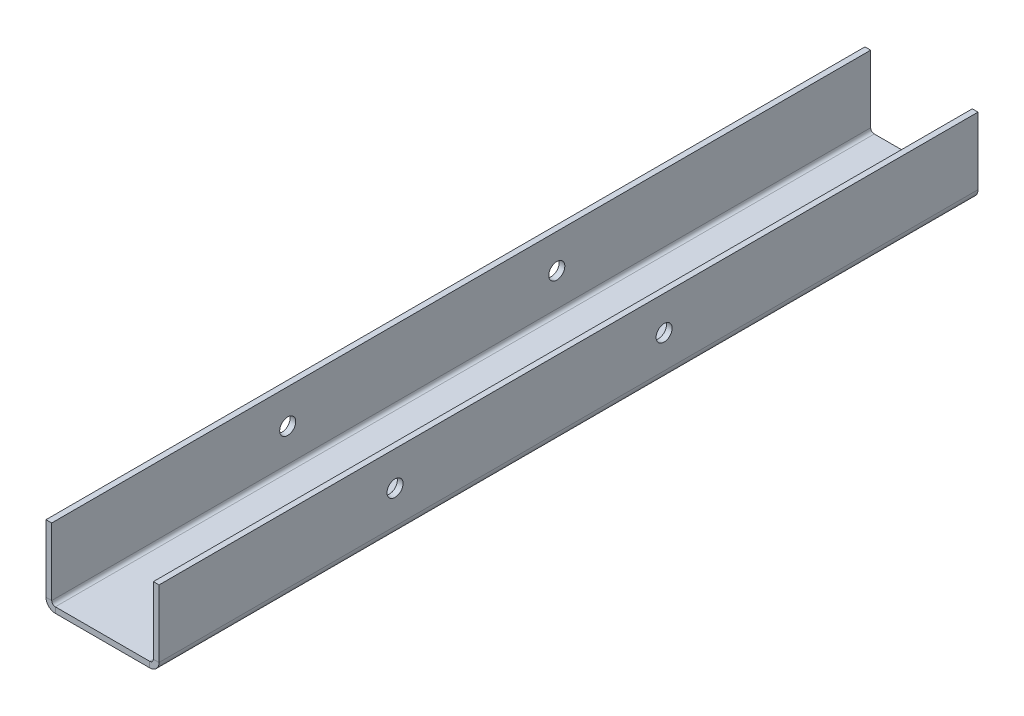
ISO-10303-21;
HEADER;
FILE_DESCRIPTION(('STEP AP214'),'2;1');
FILE_NAME('part.step','',(''),(''),'','','');
FILE_SCHEMA(('AUTOMOTIVE_DESIGN { 1 0 10303 214 1 1 1 1 }'));
ENDSEC;
DATA;
#1=APPLICATION_CONTEXT('core data for automotive mechanical design processes');
#2=APPLICATION_PROTOCOL_DEFINITION('international standard','automotive_design',2000,#1);
#3=PRODUCT_CONTEXT('',#1,'mechanical');
#4=PRODUCT('Part','Part','',(#3));
#5=PRODUCT_RELATED_PRODUCT_CATEGORY('part','',(#4));
#6=PRODUCT_DEFINITION_FORMATION('','',#4);
#7=PRODUCT_DEFINITION_CONTEXT('part definition',#1,'design');
#8=PRODUCT_DEFINITION('design','',#6,#7);
#9=PRODUCT_DEFINITION_SHAPE('','',#8);
#10=(LENGTH_UNIT() NAMED_UNIT(*) SI_UNIT(.MILLI.,.METRE.));
#11=(NAMED_UNIT(*) PLANE_ANGLE_UNIT() SI_UNIT($,.RADIAN.));
#12=(NAMED_UNIT(*) SI_UNIT($,.STERADIAN.) SOLID_ANGLE_UNIT());
#13=UNCERTAINTY_MEASURE_WITH_UNIT(LENGTH_MEASURE(1.E-05),#10,'distance_accuracy_value','');
#14=(GEOMETRIC_REPRESENTATION_CONTEXT(3) GLOBAL_UNCERTAINTY_ASSIGNED_CONTEXT((#13)) GLOBAL_UNIT_ASSIGNED_CONTEXT((#10,
#11,#12)) REPRESENTATION_CONTEXT('',''));
#15=CARTESIAN_POINT('',(0.,0.,0.));
#16=DIRECTION('',(0.,0.,1.));
#17=DIRECTION('',(1.,0.,0.));
#18=AXIS2_PLACEMENT_3D('',#15,#16,#17);
#19=CARTESIAN_POINT('',(10.,-1.21,-86.75));
#20=DIRECTION('',(0.,0.,-1.));
#21=DIRECTION('',(-1.,0.,0.));
#22=AXIS2_PLACEMENT_3D('',#19,#20,#21);
#23=PLANE('',#22);
#24=DIRECTION('',(-1.,0.,0.));
#25=VECTOR('',#24,1.);
#26=CARTESIAN_POINT('',(10.,0.,-86.75));
#27=LINE('',#26,#25);
#28=CARTESIAN_POINT('',(10.,0.,-86.75));
#29=VERTEX_POINT('',#28);
#30=CARTESIAN_POINT('',(-10.,0.,-86.75));
#31=VERTEX_POINT('',#30);
#32=EDGE_CURVE('E117',#29,#31,#27,.T.);
#33=ORIENTED_EDGE('',*,*,#32,.F.);
#34=DIRECTION('',(0.,1.,0.));
#35=VECTOR('',#34,1.);
#36=CARTESIAN_POINT('',(10.,-1.21,-86.75));
#37=LINE('',#36,#35);
#38=CARTESIAN_POINT('',(10.,-1.21,-86.75));
#39=VERTEX_POINT('',#38);
#40=EDGE_CURVE('E85',#39,#29,#37,.T.);
#41=ORIENTED_EDGE('',*,*,#40,.F.);
#42=DIRECTION('',(-1.,0.,0.));
#43=VECTOR('',#42,1.);
#44=CARTESIAN_POINT('',(10.,-1.21,-86.75));
#45=LINE('',#44,#43);
#46=CARTESIAN_POINT('',(-10.,-1.21,-86.75));
#47=VERTEX_POINT('',#46);
#48=EDGE_CURVE('E119',#39,#47,#45,.T.);
#49=ORIENTED_EDGE('',*,*,#48,.T.);
#50=DIRECTION('',(0.,1.,0.));
#51=VECTOR('',#50,1.);
#52=CARTESIAN_POINT('',(-10.,-1.21,-86.75));
#53=LINE('',#52,#51);
#54=EDGE_CURVE('E13',#47,#31,#53,.T.);
#55=ORIENTED_EDGE('',*,*,#54,.T.);
#56=EDGE_LOOP('',(#33,#41,#49,#55));
#57=FACE_BOUND('',#56,.T.);
#58=ADVANCED_FACE('F75',(#57),#23,.T.);
#59=CARTESIAN_POINT('',(10.,-1.21,86.75));
#60=DIRECTION('',(0.,0.,1.));
#61=DIRECTION('',(1.,0.,0.));
#62=AXIS2_PLACEMENT_3D('',#59,#60,#61);
#63=PLANE('',#62);
#64=DIRECTION('',(1.,0.,0.));
#65=VECTOR('',#64,1.);
#66=CARTESIAN_POINT('',(10.,0.,86.75));
#67=LINE('',#66,#65);
#68=CARTESIAN_POINT('',(-10.,0.,86.75));
#69=VERTEX_POINT('',#68);
#70=CARTESIAN_POINT('',(10.,0.,86.75));
#71=VERTEX_POINT('',#70);
#72=EDGE_CURVE('E140',#69,#71,#67,.T.);
#73=ORIENTED_EDGE('',*,*,#72,.F.);
#74=DIRECTION('',(0.,1.,0.));
#75=VECTOR('',#74,1.);
#76=CARTESIAN_POINT('',(-10.,-1.21,86.75));
#77=LINE('',#76,#75);
#78=CARTESIAN_POINT('',(-10.,-1.21,86.75));
#79=VERTEX_POINT('',#78);
#80=EDGE_CURVE('E162',#79,#69,#77,.T.);
#81=ORIENTED_EDGE('',*,*,#80,.F.);
#82=DIRECTION('',(1.,0.,0.));
#83=VECTOR('',#82,1.);
#84=CARTESIAN_POINT('',(10.,-1.21,86.75));
#85=LINE('',#84,#83);
#86=CARTESIAN_POINT('',(10.,-1.21,86.75));
#87=VERTEX_POINT('',#86);
#88=EDGE_CURVE('E156',#79,#87,#85,.T.);
#89=ORIENTED_EDGE('',*,*,#88,.T.);
#90=DIRECTION('',(0.,1.,0.));
#91=VECTOR('',#90,1.);
#92=CARTESIAN_POINT('',(10.,-1.21,86.75));
#93=LINE('',#92,#91);
#94=EDGE_CURVE('E167',#87,#71,#93,.T.);
#95=ORIENTED_EDGE('',*,*,#94,.T.);
#96=EDGE_LOOP('',(#73,#81,#89,#95));
#97=FACE_BOUND('',#96,.T.);
#98=ADVANCED_FACE('F77',(#97),#63,.T.);
#99=CARTESIAN_POINT('',(0.,-1.21,0.));
#100=DIRECTION('',(0.,1.,0.));
#101=DIRECTION('',(0.,0.,1.));
#102=AXIS2_PLACEMENT_3D('',#99,#100,#101);
#103=PLANE('',#102);
#104=CARTESIAN_POINT('',(0.,-1.21,69.75));
#105=DIRECTION('',(0.,-1.,0.));
#106=DIRECTION('',(0.,0.,-1.));
#107=AXIS2_PLACEMENT_3D('',#104,#105,#106);
#108=CIRCLE('',#107,1.20000000000001);
#109=CARTESIAN_POINT('',(0.,-1.21,68.55));
#110=VERTEX_POINT('',#109);
#111=EDGE_CURVE('E173',#110,#110,#108,.T.);
#112=ORIENTED_EDGE('',*,*,#111,.F.);
#113=EDGE_LOOP('',(#112));
#114=FACE_BOUND('',#113,.T.);
#115=DIRECTION('',(0.,0.,1.));
#116=VECTOR('',#115,1.);
#117=CARTESIAN_POINT('',(-10.,-1.21,86.75));
#118=LINE('',#117,#116);
#119=EDGE_CURVE('E94',#47,#79,#118,.T.);
#120=ORIENTED_EDGE('',*,*,#119,.F.);
#121=ORIENTED_EDGE('',*,*,#48,.F.);
#122=DIRECTION('',(0.,0.,-1.));
#123=VECTOR('',#122,1.);
#124=CARTESIAN_POINT('',(10.,-1.21,86.75));
#125=LINE('',#124,#123);
#126=EDGE_CURVE('E159',#87,#39,#125,.T.);
#127=ORIENTED_EDGE('',*,*,#126,.F.);
#128=ORIENTED_EDGE('',*,*,#88,.F.);
#129=EDGE_LOOP('',(#120,#121,#127,#128));
#130=FACE_BOUND('',#129,.T.);
#131=ADVANCED_FACE('F314',(#114,#130),#103,.F.);
#132=CARTESIAN_POINT('',(0.,0.,0.));
#133=DIRECTION('',(0.,1.,0.));
#134=DIRECTION('',(0.,0.,1.));
#135=AXIS2_PLACEMENT_3D('',#132,#133,#134);
#136=PLANE('',#135);
#137=CARTESIAN_POINT('',(0.,0.,69.75));
#138=DIRECTION('',(0.,1.,0.));
#139=DIRECTION('',(0.,0.,1.));
#140=AXIS2_PLACEMENT_3D('',#137,#138,#139);
#141=CIRCLE('',#140,1.20000000000001);
#142=CARTESIAN_POINT('',(0.,0.,70.95));
#143=VERTEX_POINT('',#142);
#144=EDGE_CURVE('E170',#143,#143,#141,.T.);
#145=ORIENTED_EDGE('',*,*,#144,.F.);
#146=EDGE_LOOP('',(#145));
#147=FACE_BOUND('',#146,.T.);
#148=DIRECTION('',(0.,0.,1.));
#149=VECTOR('',#148,1.);
#150=CARTESIAN_POINT('',(-10.,0.,86.75));
#151=LINE('',#150,#149);
#152=EDGE_CURVE('E127',#31,#69,#151,.T.);
#153=ORIENTED_EDGE('',*,*,#152,.T.);
#154=ORIENTED_EDGE('',*,*,#72,.T.);
#155=DIRECTION('',(0.,0.,-1.));
#156=VECTOR('',#155,1.);
#157=CARTESIAN_POINT('',(10.,0.,86.75));
#158=LINE('',#157,#156);
#159=EDGE_CURVE('E112',#71,#29,#158,.T.);
#160=ORIENTED_EDGE('',*,*,#159,.T.);
#161=ORIENTED_EDGE('',*,*,#32,.T.);
#162=EDGE_LOOP('',(#153,#154,#160,#161));
#163=FACE_BOUND('',#162,.T.);
#164=ADVANCED_FACE('F126',(#147,#163),#136,.T.);
#165=CARTESIAN_POINT('',(-10.,0.762000000000001,-86.75));
#166=DIRECTION('',(0.,0.,-1.));
#167=DIRECTION('',(-1.,0.,0.));
#168=AXIS2_PLACEMENT_3D('',#165,#166,#167);
#169=PLANE('',#168);
#170=DIRECTION('',(1.,0.,0.));
#171=VECTOR('',#170,1.);
#172=CARTESIAN_POINT('',(-11.972,0.761999999999993,-86.75));
#173=LINE('',#172,#171);
#174=CARTESIAN_POINT('',(-10.762,0.761999999999998,-86.75));
#175=VERTEX_POINT('',#174);
#176=CARTESIAN_POINT('',(-11.972,0.761999999999994,-86.75));
#177=VERTEX_POINT('',#176);
#178=EDGE_CURVE('E146',#175,#177,#173,.F.);
#179=ORIENTED_EDGE('',*,*,#178,.F.);
#180=CARTESIAN_POINT('',(-10.,0.762000000000001,-86.75));
#181=DIRECTION('',(0.,0.,1.));
#182=DIRECTION('',(1.,0.,0.));
#183=AXIS2_PLACEMENT_3D('',#180,#181,#182);
#184=CIRCLE('',#183,0.761999999999999);
#185=EDGE_CURVE('E136',#31,#175,#184,.F.);
#186=ORIENTED_EDGE('',*,*,#185,.F.);
#187=ORIENTED_EDGE('',*,*,#54,.F.);
#188=CARTESIAN_POINT('',(-10.,0.762000000000001,-86.75));
#189=DIRECTION('',(0.,0.,1.));
#190=DIRECTION('',(1.,0.,0.));
#191=AXIS2_PLACEMENT_3D('',#188,#189,#190);
#192=CIRCLE('',#191,1.972);
#193=EDGE_CURVE('E141',#47,#177,#192,.F.);
#194=ORIENTED_EDGE('',*,*,#193,.T.);
#195=EDGE_LOOP('',(#179,#186,#187,#194));
#196=FACE_BOUND('',#195,.T.);
#197=ADVANCED_FACE('F144',(#196),#169,.T.);
#198=CARTESIAN_POINT('',(-10.,0.762000000000001,86.75));
#199=DIRECTION('',(0.,0.,-1.));
#200=DIRECTION('',(-1.,0.,0.));
#201=AXIS2_PLACEMENT_3D('',#198,#199,#200);
#202=PLANE('',#201);
#203=CARTESIAN_POINT('',(-10.,0.762000000000001,86.75));
#204=DIRECTION('',(0.,0.,1.));
#205=DIRECTION('',(1.,0.,0.));
#206=AXIS2_PLACEMENT_3D('',#203,#204,#205);
#207=CIRCLE('',#206,0.761999999999999);
#208=CARTESIAN_POINT('',(-10.762,0.761999999999998,86.75));
#209=VERTEX_POINT('',#208);
#210=EDGE_CURVE('E139',#209,#69,#207,.T.);
#211=ORIENTED_EDGE('',*,*,#210,.F.);
#212=DIRECTION('',(1.,0.,0.));
#213=VECTOR('',#212,1.);
#214=CARTESIAN_POINT('',(-10.762,0.761999999999999,86.75));
#215=LINE('',#214,#213);
#216=CARTESIAN_POINT('',(-11.972,0.761999999999995,86.75));
#217=VERTEX_POINT('',#216);
#218=EDGE_CURVE('E267',#209,#217,#215,.F.);
#219=ORIENTED_EDGE('',*,*,#218,.T.);
#220=CARTESIAN_POINT('',(-10.,0.762000000000001,86.75));
#221=DIRECTION('',(0.,0.,1.));
#222=DIRECTION('',(1.,0.,0.));
#223=AXIS2_PLACEMENT_3D('',#220,#221,#222);
#224=CIRCLE('',#223,1.972);
#225=EDGE_CURVE('E147',#217,#79,#224,.T.);
#226=ORIENTED_EDGE('',*,*,#225,.T.);
#227=ORIENTED_EDGE('',*,*,#80,.T.);
#228=EDGE_LOOP('',(#211,#219,#226,#227));
#229=FACE_BOUND('',#228,.T.);
#230=ADVANCED_FACE('F303',(#229),#202,.F.);
#231=CARTESIAN_POINT('',(-10.,0.762000000000001,86.75));
#232=DIRECTION('',(0.,0.,1.));
#233=DIRECTION('',(-1.,0.,0.));
#234=AXIS2_PLACEMENT_3D('',#231,#232,#233);
#235=CYLINDRICAL_SURFACE('',#234,1.972);
#236=ORIENTED_EDGE('',*,*,#119,.T.);
#237=ORIENTED_EDGE('',*,*,#225,.F.);
#238=DIRECTION('',(0.,0.,1.));
#239=VECTOR('',#238,1.);
#240=CARTESIAN_POINT('',(-11.972,0.761999999999993,-86.75));
#241=LINE('',#240,#239);
#242=EDGE_CURVE('E264',#217,#177,#241,.F.);
#243=ORIENTED_EDGE('',*,*,#242,.T.);
#244=ORIENTED_EDGE('',*,*,#193,.F.);
#245=EDGE_LOOP('',(#236,#237,#243,#244));
#246=FACE_BOUND('',#245,.T.);
#247=ADVANCED_FACE('F317',(#246),#235,.T.);
#248=CARTESIAN_POINT('',(-10.,0.762000000000001,86.75));
#249=DIRECTION('',(0.,0.,1.));
#250=DIRECTION('',(-1.,0.,0.));
#251=AXIS2_PLACEMENT_3D('',#248,#249,#250);
#252=CYLINDRICAL_SURFACE('',#251,0.761999999999999);
#253=ORIENTED_EDGE('',*,*,#152,.F.);
#254=ORIENTED_EDGE('',*,*,#185,.T.);
#255=DIRECTION('',(0.,0.,1.));
#256=VECTOR('',#255,1.);
#257=CARTESIAN_POINT('',(-10.762,0.761999999999997,-86.75));
#258=LINE('',#257,#256);
#259=EDGE_CURVE('E270',#175,#209,#258,.T.);
#260=ORIENTED_EDGE('',*,*,#259,.T.);
#261=ORIENTED_EDGE('',*,*,#210,.T.);
#262=EDGE_LOOP('',(#253,#254,#260,#261));
#263=FACE_BOUND('',#262,.T.);
#264=ADVANCED_FACE('F133',(#263),#252,.F.);
#265=CARTESIAN_POINT('',(-11.972,0.,-86.75));
#266=DIRECTION('',(0.,0.,1.));
#267=DIRECTION('',(1.,0.,0.));
#268=AXIS2_PLACEMENT_3D('',#265,#266,#267);
#269=PLANE('',#268);
#270=ORIENTED_EDGE('',*,*,#178,.T.);
#271=DIRECTION('',(0.,-1.,0.));
#272=VECTOR('',#271,1.);
#273=CARTESIAN_POINT('',(-11.972,0.,-86.75));
#274=LINE('',#273,#272);
#275=CARTESIAN_POINT('',(-11.972,15.,-86.75));
#276=VERTEX_POINT('',#275);
#277=EDGE_CURVE('E252',#276,#177,#274,.T.);
#278=ORIENTED_EDGE('',*,*,#277,.F.);
#279=DIRECTION('',(1.,0.,0.));
#280=VECTOR('',#279,1.);
#281=CARTESIAN_POINT('',(-11.972,15.,-86.75));
#282=LINE('',#281,#280);
#283=CARTESIAN_POINT('',(-10.762,15.,-86.75));
#284=VERTEX_POINT('',#283);
#285=EDGE_CURVE('E243',#276,#284,#282,.T.);
#286=ORIENTED_EDGE('',*,*,#285,.T.);
#287=DIRECTION('',(0.,1.,0.));
#288=VECTOR('',#287,1.);
#289=CARTESIAN_POINT('',(-10.762,0.,-86.75));
#290=LINE('',#289,#288);
#291=EDGE_CURVE('E261',#284,#175,#290,.F.);
#292=ORIENTED_EDGE('',*,*,#291,.T.);
#293=EDGE_LOOP('',(#270,#278,#286,#292));
#294=FACE_BOUND('',#293,.T.);
#295=ADVANCED_FACE('F278',(#294),#269,.F.);
#296=CARTESIAN_POINT('',(-11.972,15.,86.75));
#297=DIRECTION('',(0.,0.,-1.));
#298=DIRECTION('',(-1.,0.,0.));
#299=AXIS2_PLACEMENT_3D('',#296,#297,#298);
#300=PLANE('',#299);
#301=ORIENTED_EDGE('',*,*,#218,.F.);
#302=DIRECTION('',(0.,-1.,0.));
#303=VECTOR('',#302,1.);
#304=CARTESIAN_POINT('',(-10.762,15.,86.75));
#305=LINE('',#304,#303);
#306=CARTESIAN_POINT('',(-10.762,15.,86.75));
#307=VERTEX_POINT('',#306);
#308=EDGE_CURVE('E258',#209,#307,#305,.F.);
#309=ORIENTED_EDGE('',*,*,#308,.T.);
#310=DIRECTION('',(1.,0.,0.));
#311=VECTOR('',#310,1.);
#312=CARTESIAN_POINT('',(-11.972,15.,86.75));
#313=LINE('',#312,#311);
#314=CARTESIAN_POINT('',(-11.972,15.,86.75));
#315=VERTEX_POINT('',#314);
#316=EDGE_CURVE('E151',#315,#307,#313,.T.);
#317=ORIENTED_EDGE('',*,*,#316,.F.);
#318=DIRECTION('',(0.,1.,0.));
#319=VECTOR('',#318,1.);
#320=CARTESIAN_POINT('',(-11.972,0.,86.75));
#321=LINE('',#320,#319);
#322=EDGE_CURVE('E249',#217,#315,#321,.T.);
#323=ORIENTED_EDGE('',*,*,#322,.F.);
#324=EDGE_LOOP('',(#301,#309,#317,#323));
#325=FACE_BOUND('',#324,.T.);
#326=ADVANCED_FACE('F306',(#325),#300,.F.);
#327=CARTESIAN_POINT('',(-11.972,0.,0.));
#328=DIRECTION('',(1.,0.,0.));
#329=DIRECTION('',(0.,1.,0.));
#330=AXIS2_PLACEMENT_3D('',#327,#328,#329);
#331=PLANE('',#330);
#332=CARTESIAN_POINT('',(-11.972,7.76200000000003,36.7500000000001));
#333=DIRECTION('',(-1.,0.,0.));
#334=DIRECTION('',(0.,0.,1.));
#335=AXIS2_PLACEMENT_3D('',#332,#333,#334);
#336=CIRCLE('',#335,1.7);
#337=CARTESIAN_POINT('',(-11.972,7.76200000000003,38.4500000000001));
#338=VERTEX_POINT('',#337);
#339=EDGE_CURVE('E586',#338,#338,#336,.T.);
#340=ORIENTED_EDGE('',*,*,#339,.F.);
#341=EDGE_LOOP('',(#340));
#342=FACE_BOUND('',#341,.T.);
#343=CARTESIAN_POINT('',(-11.972,7.76199999999995,-20.2499999999999));
#344=DIRECTION('',(-1.,0.,0.));
#345=DIRECTION('',(0.,0.,1.));
#346=AXIS2_PLACEMENT_3D('',#343,#344,#345);
#347=CIRCLE('',#346,1.7);
#348=CARTESIAN_POINT('',(-11.972,7.76199999999995,-18.5499999999999));
#349=VERTEX_POINT('',#348);
#350=EDGE_CURVE('E183',#349,#349,#347,.T.);
#351=ORIENTED_EDGE('',*,*,#350,.F.);
#352=EDGE_LOOP('',(#351));
#353=FACE_BOUND('',#352,.T.);
#354=ORIENTED_EDGE('',*,*,#242,.F.);
#355=ORIENTED_EDGE('',*,*,#322,.T.);
#356=DIRECTION('',(0.,0.,-1.));
#357=VECTOR('',#356,1.);
#358=CARTESIAN_POINT('',(-11.972,15.,0.));
#359=LINE('',#358,#357);
#360=EDGE_CURVE('E246',#315,#276,#359,.T.);
#361=ORIENTED_EDGE('',*,*,#360,.T.);
#362=ORIENTED_EDGE('',*,*,#277,.T.);
#363=EDGE_LOOP('',(#354,#355,#361,#362));
#364=FACE_BOUND('',#363,.T.);
#365=ADVANCED_FACE('F283',(#342,#353,#364),#331,.F.);
#366=CARTESIAN_POINT('',(-10.762,0.,0.));
#367=DIRECTION('',(1.,0.,0.));
#368=DIRECTION('',(0.,1.,0.));
#369=AXIS2_PLACEMENT_3D('',#366,#367,#368);
#370=PLANE('',#369);
#371=CARTESIAN_POINT('',(-10.762,7.76200000000003,36.7500000000001));
#372=DIRECTION('',(1.,0.,0.));
#373=DIRECTION('',(0.,1.,0.));
#374=AXIS2_PLACEMENT_3D('',#371,#372,#373);
#375=CIRCLE('',#374,1.7);
#376=CARTESIAN_POINT('',(-10.762,9.46200000000003,36.7500000000001));
#377=VERTEX_POINT('',#376);
#378=EDGE_CURVE('E188',#377,#377,#375,.T.);
#379=ORIENTED_EDGE('',*,*,#378,.F.);
#380=EDGE_LOOP('',(#379));
#381=FACE_BOUND('',#380,.T.);
#382=CARTESIAN_POINT('',(-10.762,7.76199999999995,-20.2499999999999));
#383=DIRECTION('',(1.,0.,0.));
#384=DIRECTION('',(0.,1.,0.));
#385=AXIS2_PLACEMENT_3D('',#382,#383,#384);
#386=CIRCLE('',#385,1.7);
#387=CARTESIAN_POINT('',(-10.762,9.46199999999995,-20.2499999999999));
#388=VERTEX_POINT('',#387);
#389=EDGE_CURVE('E176',#388,#388,#386,.T.);
#390=ORIENTED_EDGE('',*,*,#389,.F.);
#391=EDGE_LOOP('',(#390));
#392=FACE_BOUND('',#391,.T.);
#393=ORIENTED_EDGE('',*,*,#308,.F.);
#394=ORIENTED_EDGE('',*,*,#259,.F.);
#395=ORIENTED_EDGE('',*,*,#291,.F.);
#396=DIRECTION('',(0.,0.,1.));
#397=VECTOR('',#396,1.);
#398=CARTESIAN_POINT('',(-10.762,15.,-86.75));
#399=LINE('',#398,#397);
#400=EDGE_CURVE('E255',#307,#284,#399,.F.);
#401=ORIENTED_EDGE('',*,*,#400,.F.);
#402=EDGE_LOOP('',(#393,#394,#395,#401));
#403=FACE_BOUND('',#402,.T.);
#404=ADVANCED_FACE('F299',(#381,#392,#403),#370,.T.);
#405=CARTESIAN_POINT('',(-11.972,15.,-86.75));
#406=DIRECTION('',(0.,-1.,0.));
#407=DIRECTION('',(1.,0.,0.));
#408=AXIS2_PLACEMENT_3D('',#405,#406,#407);
#409=PLANE('',#408);
#410=ORIENTED_EDGE('',*,*,#400,.T.);
#411=ORIENTED_EDGE('',*,*,#285,.F.);
#412=ORIENTED_EDGE('',*,*,#360,.F.);
#413=ORIENTED_EDGE('',*,*,#316,.T.);
#414=EDGE_LOOP('',(#410,#411,#412,#413));
#415=FACE_BOUND('',#414,.T.);
#416=ADVANCED_FACE('F292',(#415),#409,.F.);
#417=CARTESIAN_POINT('',(10.,0.762,86.75));
#418=DIRECTION('',(0.,0.,1.));
#419=DIRECTION('',(1.,0.,0.));
#420=AXIS2_PLACEMENT_3D('',#417,#418,#419);
#421=PLANE('',#420);
#422=DIRECTION('',(-1.,0.,0.));
#423=VECTOR('',#422,1.);
#424=CARTESIAN_POINT('',(11.972,0.761999999999993,86.75));
#425=LINE('',#424,#423);
#426=CARTESIAN_POINT('',(10.762,0.761999999999997,86.75));
#427=VERTEX_POINT('',#426);
#428=CARTESIAN_POINT('',(11.972,0.761999999999993,86.75));
#429=VERTEX_POINT('',#428);
#430=EDGE_CURVE('E172',#427,#429,#425,.F.);
#431=ORIENTED_EDGE('',*,*,#430,.F.);
#432=CARTESIAN_POINT('',(10.,0.762,86.75));
#433=DIRECTION('',(0.,0.,-1.));
#434=DIRECTION('',(-1.,0.,0.));
#435=AXIS2_PLACEMENT_3D('',#432,#433,#434);
#436=CIRCLE('',#435,0.762000000000001);
#437=EDGE_CURVE('E236',#71,#427,#436,.F.);
#438=ORIENTED_EDGE('',*,*,#437,.F.);
#439=ORIENTED_EDGE('',*,*,#94,.F.);
#440=CARTESIAN_POINT('',(10.,0.762,86.75));
#441=DIRECTION('',(0.,0.,-1.));
#442=DIRECTION('',(-1.,0.,0.));
#443=AXIS2_PLACEMENT_3D('',#440,#441,#442);
#444=CIRCLE('',#443,1.972);
#445=EDGE_CURVE('E230',#87,#429,#444,.F.);
#446=ORIENTED_EDGE('',*,*,#445,.T.);
#447=EDGE_LOOP('',(#431,#438,#439,#446));
#448=FACE_BOUND('',#447,.T.);
#449=ADVANCED_FACE('F387',(#448),#421,.T.);
#450=CARTESIAN_POINT('',(10.,0.762,-86.75));
#451=DIRECTION('',(0.,0.,1.));
#452=DIRECTION('',(1.,0.,0.));
#453=AXIS2_PLACEMENT_3D('',#450,#451,#452);
#454=PLANE('',#453);
#455=CARTESIAN_POINT('',(10.,0.762,-86.75));
#456=DIRECTION('',(0.,0.,-1.));
#457=DIRECTION('',(-1.,0.,0.));
#458=AXIS2_PLACEMENT_3D('',#455,#456,#457);
#459=CIRCLE('',#458,0.762000000000001);
#460=CARTESIAN_POINT('',(10.762,0.761999999999997,-86.75));
#461=VERTEX_POINT('',#460);
#462=EDGE_CURVE('E197',#461,#29,#459,.T.);
#463=ORIENTED_EDGE('',*,*,#462,.F.);
#464=DIRECTION('',(-1.,0.,0.));
#465=VECTOR('',#464,1.);
#466=CARTESIAN_POINT('',(10.762,0.761999999999997,-86.75));
#467=LINE('',#466,#465);
#468=CARTESIAN_POINT('',(11.972,0.761999999999993,-86.75));
#469=VERTEX_POINT('',#468);
#470=EDGE_CURVE('E222',#461,#469,#467,.F.);
#471=ORIENTED_EDGE('',*,*,#470,.T.);
#472=CARTESIAN_POINT('',(10.,0.762,-86.75));
#473=DIRECTION('',(0.,0.,-1.));
#474=DIRECTION('',(-1.,0.,0.));
#475=AXIS2_PLACEMENT_3D('',#472,#473,#474);
#476=CIRCLE('',#475,1.972);
#477=EDGE_CURVE('E233',#469,#39,#476,.T.);
#478=ORIENTED_EDGE('',*,*,#477,.T.);
#479=ORIENTED_EDGE('',*,*,#40,.T.);
#480=EDGE_LOOP('',(#463,#471,#478,#479));
#481=FACE_BOUND('',#480,.T.);
#482=ADVANCED_FACE('F413',(#481),#454,.F.);
#483=CARTESIAN_POINT('',(10.,0.762,-86.75));
#484=DIRECTION('',(0.,0.,-1.));
#485=DIRECTION('',(1.,0.,0.));
#486=AXIS2_PLACEMENT_3D('',#483,#484,#485);
#487=CYLINDRICAL_SURFACE('',#486,1.972);
#488=ORIENTED_EDGE('',*,*,#126,.T.);
#489=ORIENTED_EDGE('',*,*,#477,.F.);
#490=DIRECTION('',(0.,0.,-1.));
#491=VECTOR('',#490,1.);
#492=CARTESIAN_POINT('',(11.972,0.761999999999993,86.75));
#493=LINE('',#492,#491);
#494=EDGE_CURVE('E219',#469,#429,#493,.F.);
#495=ORIENTED_EDGE('',*,*,#494,.T.);
#496=ORIENTED_EDGE('',*,*,#445,.F.);
#497=EDGE_LOOP('',(#488,#489,#495,#496));
#498=FACE_BOUND('',#497,.T.);
#499=ADVANCED_FACE('F424',(#498),#487,.T.);
#500=CARTESIAN_POINT('',(10.,0.762,-86.75));
#501=DIRECTION('',(0.,0.,-1.));
#502=DIRECTION('',(1.,0.,0.));
#503=AXIS2_PLACEMENT_3D('',#500,#501,#502);
#504=CYLINDRICAL_SURFACE('',#503,0.762000000000001);
#505=ORIENTED_EDGE('',*,*,#159,.F.);
#506=ORIENTED_EDGE('',*,*,#437,.T.);
#507=DIRECTION('',(0.,0.,-1.));
#508=VECTOR('',#507,1.);
#509=CARTESIAN_POINT('',(10.762,0.761999999999997,86.75));
#510=LINE('',#509,#508);
#511=EDGE_CURVE('E225',#427,#461,#510,.T.);
#512=ORIENTED_EDGE('',*,*,#511,.T.);
#513=ORIENTED_EDGE('',*,*,#462,.T.);
#514=EDGE_LOOP('',(#505,#506,#512,#513));
#515=FACE_BOUND('',#514,.T.);
#516=ADVANCED_FACE('F435',(#515),#504,.F.);
#517=CARTESIAN_POINT('',(11.972,0.,86.75));
#518=DIRECTION('',(0.,0.,-1.));
#519=DIRECTION('',(-1.,0.,0.));
#520=AXIS2_PLACEMENT_3D('',#517,#518,#519);
#521=PLANE('',#520);
#522=ORIENTED_EDGE('',*,*,#430,.T.);
#523=DIRECTION('',(0.,-1.,0.));
#524=VECTOR('',#523,1.);
#525=CARTESIAN_POINT('',(11.972,0.,86.75));
#526=LINE('',#525,#524);
#527=CARTESIAN_POINT('',(11.9720000000001,15.,86.75));
#528=VERTEX_POINT('',#527);
#529=EDGE_CURVE('E207',#528,#429,#526,.T.);
#530=ORIENTED_EDGE('',*,*,#529,.F.);
#531=DIRECTION('',(-1.,0.,0.));
#532=VECTOR('',#531,1.);
#533=CARTESIAN_POINT('',(11.9720000000001,15.,86.75));
#534=LINE('',#533,#532);
#535=CARTESIAN_POINT('',(10.7620000000001,15.,86.75));
#536=VERTEX_POINT('',#535);
#537=EDGE_CURVE('E198',#528,#536,#534,.T.);
#538=ORIENTED_EDGE('',*,*,#537,.T.);
#539=DIRECTION('',(0.,1.,0.));
#540=VECTOR('',#539,1.);
#541=CARTESIAN_POINT('',(10.762,0.,86.75));
#542=LINE('',#541,#540);
#543=EDGE_CURVE('E216',#536,#427,#542,.F.);
#544=ORIENTED_EDGE('',*,*,#543,.T.);
#545=EDGE_LOOP('',(#522,#530,#538,#544));
#546=FACE_BOUND('',#545,.T.);
#547=ADVANCED_FACE('F446',(#546),#521,.F.);
#548=CARTESIAN_POINT('',(11.9720000000001,15.,-86.75));
#549=DIRECTION('',(0.,0.,1.));
#550=DIRECTION('',(1.,0.,0.));
#551=AXIS2_PLACEMENT_3D('',#548,#549,#550);
#552=PLANE('',#551);
#553=ORIENTED_EDGE('',*,*,#470,.F.);
#554=DIRECTION('',(0.,-1.,0.));
#555=VECTOR('',#554,1.);
#556=CARTESIAN_POINT('',(10.7620000000001,15.,-86.75));
#557=LINE('',#556,#555);
#558=CARTESIAN_POINT('',(10.7620000000001,15.,-86.75));
#559=VERTEX_POINT('',#558);
#560=EDGE_CURVE('E213',#461,#559,#557,.F.);
#561=ORIENTED_EDGE('',*,*,#560,.T.);
#562=DIRECTION('',(-1.,0.,0.));
#563=VECTOR('',#562,1.);
#564=CARTESIAN_POINT('',(11.9720000000001,15.,-86.75));
#565=LINE('',#564,#563);
#566=CARTESIAN_POINT('',(11.9720000000001,15.,-86.75));
#567=VERTEX_POINT('',#566);
#568=EDGE_CURVE('E194',#567,#559,#565,.T.);
#569=ORIENTED_EDGE('',*,*,#568,.F.);
#570=DIRECTION('',(0.,1.,0.));
#571=VECTOR('',#570,1.);
#572=CARTESIAN_POINT('',(11.972,0.,-86.75));
#573=LINE('',#572,#571);
#574=EDGE_CURVE('E204',#469,#567,#573,.T.);
#575=ORIENTED_EDGE('',*,*,#574,.F.);
#576=EDGE_LOOP('',(#553,#561,#569,#575));
#577=FACE_BOUND('',#576,.T.);
#578=ADVANCED_FACE('F457',(#577),#552,.F.);
#579=CARTESIAN_POINT('',(11.972,0.,0.));
#580=DIRECTION('',(-1.,0.,0.));
#581=DIRECTION('',(0.,-1.,0.));
#582=AXIS2_PLACEMENT_3D('',#579,#580,#581);
#583=PLANE('',#582);
#584=CARTESIAN_POINT('',(11.9720000000001,7.76200000000003,36.7500000000001));
#585=DIRECTION('',(-1.,0.,0.));
#586=DIRECTION('',(0.,0.,1.));
#587=AXIS2_PLACEMENT_3D('',#584,#585,#586);
#588=CIRCLE('',#587,1.69999999999999);
#589=CARTESIAN_POINT('',(11.9720000000001,7.76200000000003,38.4500000000001));
#590=VERTEX_POINT('',#589);
#591=EDGE_CURVE('E587',#590,#590,#588,.T.);
#592=ORIENTED_EDGE('',*,*,#591,.T.);
#593=EDGE_LOOP('',(#592));
#594=FACE_BOUND('',#593,.T.);
#595=CARTESIAN_POINT('',(11.9720000000001,7.76199999999995,-20.2499999999999));
#596=DIRECTION('',(-1.,0.,0.));
#597=DIRECTION('',(0.,0.,1.));
#598=AXIS2_PLACEMENT_3D('',#595,#596,#597);
#599=CIRCLE('',#598,1.69999999999999);
#600=CARTESIAN_POINT('',(11.9720000000001,7.76199999999995,-18.5499999999999));
#601=VERTEX_POINT('',#600);
#602=EDGE_CURVE('E177',#601,#601,#599,.T.);
#603=ORIENTED_EDGE('',*,*,#602,.T.);
#604=EDGE_LOOP('',(#603));
#605=FACE_BOUND('',#604,.T.);
#606=ORIENTED_EDGE('',*,*,#494,.F.);
#607=ORIENTED_EDGE('',*,*,#574,.T.);
#608=DIRECTION('',(0.,0.,1.));
#609=VECTOR('',#608,1.);
#610=CARTESIAN_POINT('',(11.9720000000001,15.,0.));
#611=LINE('',#610,#609);
#612=EDGE_CURVE('E201',#567,#528,#611,.T.);
#613=ORIENTED_EDGE('',*,*,#612,.T.);
#614=ORIENTED_EDGE('',*,*,#529,.T.);
#615=EDGE_LOOP('',(#606,#607,#613,#614));
#616=FACE_BOUND('',#615,.T.);
#617=ADVANCED_FACE('F468',(#594,#605,#616),#583,.F.);
#618=CARTESIAN_POINT('',(10.762,0.,0.));
#619=DIRECTION('',(-1.,0.,0.));
#620=DIRECTION('',(0.,-1.,0.));
#621=AXIS2_PLACEMENT_3D('',#618,#619,#620);
#622=PLANE('',#621);
#623=CARTESIAN_POINT('',(10.762,7.76200000000003,36.7500000000001));
#624=DIRECTION('',(-1.,0.,0.));
#625=DIRECTION('',(0.,-1.,0.));
#626=AXIS2_PLACEMENT_3D('',#623,#624,#625);
#627=CIRCLE('',#626,1.7);
#628=CARTESIAN_POINT('',(10.762,6.06200000000004,36.7500000000001));
#629=VERTEX_POINT('',#628);
#630=EDGE_CURVE('E79',#629,#629,#627,.T.);
#631=ORIENTED_EDGE('',*,*,#630,.F.);
#632=EDGE_LOOP('',(#631));
#633=FACE_BOUND('',#632,.T.);
#634=CARTESIAN_POINT('',(10.762,7.76199999999995,-20.2499999999999));
#635=DIRECTION('',(-1.,0.,0.));
#636=DIRECTION('',(0.,-1.,0.));
#637=AXIS2_PLACEMENT_3D('',#634,#635,#636);
#638=CIRCLE('',#637,1.7);
#639=CARTESIAN_POINT('',(10.762,6.06199999999995,-20.2499999999999));
#640=VERTEX_POINT('',#639);
#641=EDGE_CURVE('E174',#640,#640,#638,.T.);
#642=ORIENTED_EDGE('',*,*,#641,.F.);
#643=EDGE_LOOP('',(#642));
#644=FACE_BOUND('',#643,.T.);
#645=ORIENTED_EDGE('',*,*,#560,.F.);
#646=ORIENTED_EDGE('',*,*,#511,.F.);
#647=ORIENTED_EDGE('',*,*,#543,.F.);
#648=DIRECTION('',(0.,0.,-1.));
#649=VECTOR('',#648,1.);
#650=CARTESIAN_POINT('',(10.7620000000001,15.,86.75));
#651=LINE('',#650,#649);
#652=EDGE_CURVE('E210',#559,#536,#651,.F.);
#653=ORIENTED_EDGE('',*,*,#652,.F.);
#654=EDGE_LOOP('',(#645,#646,#647,#653));
#655=FACE_BOUND('',#654,.T.);
#656=ADVANCED_FACE('F483',(#633,#644,#655),#622,.T.);
#657=CARTESIAN_POINT('',(11.9720000000001,15.,86.75));
#658=DIRECTION('',(0.,-1.,0.));
#659=DIRECTION('',(1.,0.,0.));
#660=AXIS2_PLACEMENT_3D('',#657,#658,#659);
#661=PLANE('',#660);
#662=ORIENTED_EDGE('',*,*,#652,.T.);
#663=ORIENTED_EDGE('',*,*,#537,.F.);
#664=ORIENTED_EDGE('',*,*,#612,.F.);
#665=ORIENTED_EDGE('',*,*,#568,.T.);
#666=EDGE_LOOP('',(#662,#663,#664,#665));
#667=FACE_BOUND('',#666,.T.);
#668=ADVANCED_FACE('F477',(#667),#661,.F.);
#669=CARTESIAN_POINT('',(0.,3.79,69.75));
#670=DIRECTION('',(0.,-1.,0.));
#671=DIRECTION('',(0.,0.,-1.));
#672=AXIS2_PLACEMENT_3D('',#669,#670,#671);
#673=CYLINDRICAL_SURFACE('',#672,1.20000000000001);
#674=ORIENTED_EDGE('',*,*,#144,.T.);
#675=EDGE_LOOP('',(#674));
#676=FACE_BOUND('',#675,.T.);
#677=ORIENTED_EDGE('',*,*,#111,.T.);
#678=EDGE_LOOP('',(#677));
#679=FACE_BOUND('',#678,.T.);
#680=ADVANCED_FACE('F482',(#676,#679),#673,.F.);
#681=CARTESIAN_POINT('',(-11.972,7.76199999999995,-20.2499999999999));
#682=DIRECTION('',(-1.,0.,0.));
#683=DIRECTION('',(0.,0.,1.));
#684=AXIS2_PLACEMENT_3D('',#681,#682,#683);
#685=CYLINDRICAL_SURFACE('',#684,1.7);
#686=ORIENTED_EDGE('',*,*,#641,.T.);
#687=EDGE_LOOP('',(#686));
#688=FACE_BOUND('',#687,.T.);
#689=ORIENTED_EDGE('',*,*,#602,.F.);
#690=EDGE_LOOP('',(#689));
#691=FACE_BOUND('',#690,.T.);
#692=ADVANCED_FACE('F507',(#688,#691),#685,.F.);
#693=ORIENTED_EDGE('',*,*,#389,.T.);
#694=EDGE_LOOP('',(#693));
#695=FACE_BOUND('',#694,.T.);
#696=ORIENTED_EDGE('',*,*,#350,.T.);
#697=EDGE_LOOP('',(#696));
#698=FACE_BOUND('',#697,.T.);
#699=ADVANCED_FACE('F550',(#695,#698),#685,.F.);
#700=CARTESIAN_POINT('',(-11.972,7.76200000000003,36.7500000000001));
#701=DIRECTION('',(-1.,0.,0.));
#702=DIRECTION('',(0.,0.,1.));
#703=AXIS2_PLACEMENT_3D('',#700,#701,#702);
#704=CYLINDRICAL_SURFACE('',#703,1.7);
#705=ORIENTED_EDGE('',*,*,#630,.T.);
#706=EDGE_LOOP('',(#705));
#707=FACE_BOUND('',#706,.T.);
#708=ORIENTED_EDGE('',*,*,#591,.F.);
#709=EDGE_LOOP('',(#708));
#710=FACE_BOUND('',#709,.T.);
#711=ADVANCED_FACE('F559',(#707,#710),#704,.F.);
#712=ORIENTED_EDGE('',*,*,#378,.T.);
#713=EDGE_LOOP('',(#712));
#714=FACE_BOUND('',#713,.T.);
#715=ORIENTED_EDGE('',*,*,#339,.T.);
#716=EDGE_LOOP('',(#715));
#717=FACE_BOUND('',#716,.T.);
#718=ADVANCED_FACE('F568',(#714,#717),#704,.F.);
#719=CLOSED_SHELL('',(#58,#98,#131,#164,#197,#230,#247,#264,#295,#326,#365,#404,#416,#449,#482,
#499,#516,#547,#578,#617,#656,#668,#680,#692,#699,#711,#718));
#720=MANIFOLD_SOLID_BREP('B2',#719);
#721=ADVANCED_BREP_SHAPE_REPRESENTATION('',(#18,#720),#14);
#722=SHAPE_DEFINITION_REPRESENTATION(#9,#721);
ENDSEC;
END-ISO-10303-21;
